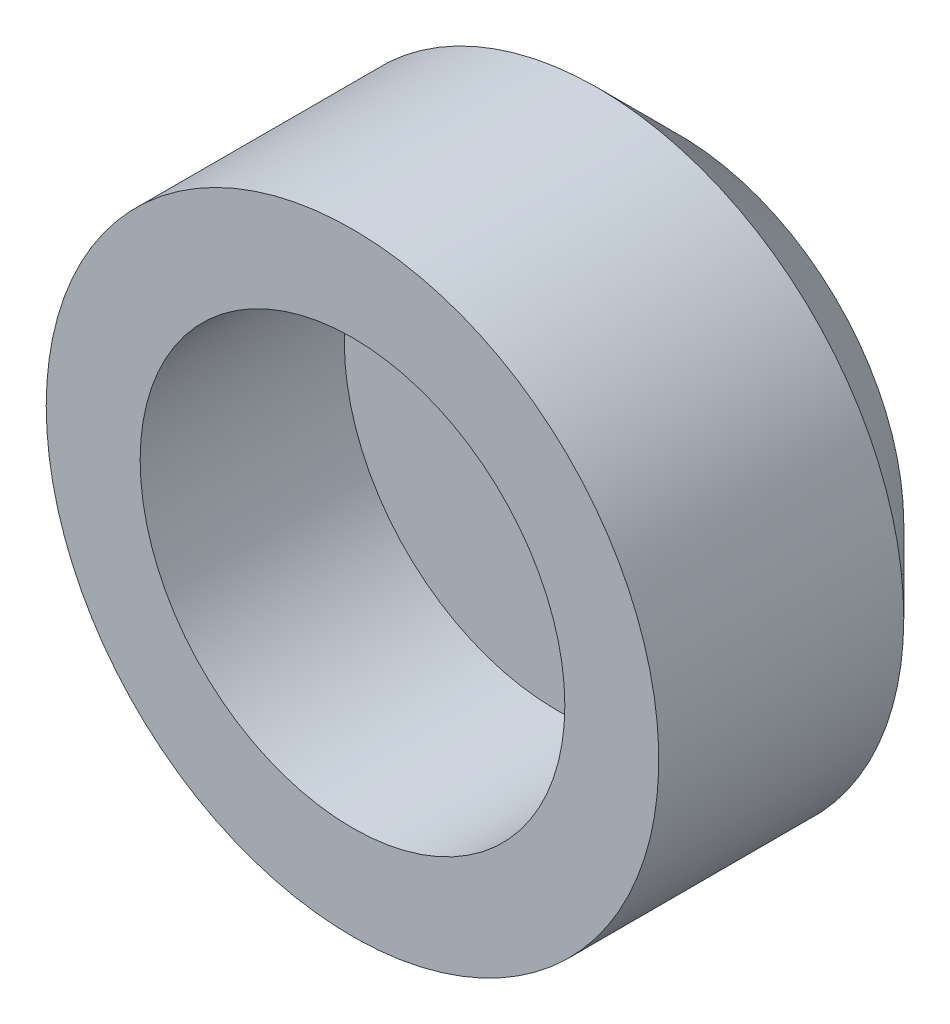
ISO-10303-21;
HEADER;
FILE_DESCRIPTION(('STEP AP214'),'2;1');
FILE_NAME('part.step','',(''),(''),'','','');
FILE_SCHEMA(('AUTOMOTIVE_DESIGN { 1 0 10303 214 1 1 1 1 }'));
ENDSEC;
DATA;
#1=APPLICATION_CONTEXT('core data for automotive mechanical design processes');
#2=APPLICATION_PROTOCOL_DEFINITION('international standard','automotive_design',2000,#1);
#3=PRODUCT_CONTEXT('',#1,'mechanical');
#4=PRODUCT('Part','Part','',(#3));
#5=PRODUCT_RELATED_PRODUCT_CATEGORY('part','',(#4));
#6=PRODUCT_DEFINITION_FORMATION('','',#4);
#7=PRODUCT_DEFINITION_CONTEXT('part definition',#1,'design');
#8=PRODUCT_DEFINITION('design','',#6,#7);
#9=PRODUCT_DEFINITION_SHAPE('','',#8);
#10=(LENGTH_UNIT() NAMED_UNIT(*) SI_UNIT(.MILLI.,.METRE.));
#11=(NAMED_UNIT(*) PLANE_ANGLE_UNIT() SI_UNIT($,.RADIAN.));
#12=(NAMED_UNIT(*) SI_UNIT($,.STERADIAN.) SOLID_ANGLE_UNIT());
#13=UNCERTAINTY_MEASURE_WITH_UNIT(LENGTH_MEASURE(1.E-05),#10,'distance_accuracy_value','');
#14=(GEOMETRIC_REPRESENTATION_CONTEXT(3) GLOBAL_UNCERTAINTY_ASSIGNED_CONTEXT((#13)) GLOBAL_UNIT_ASSIGNED_CONTEXT((#10,
#11,#12)) REPRESENTATION_CONTEXT('',''));
#15=CARTESIAN_POINT('',(0.,0.,0.));
#16=DIRECTION('',(0.,0.,1.));
#17=DIRECTION('',(1.,0.,0.));
#18=AXIS2_PLACEMENT_3D('',#15,#16,#17);
#19=CARTESIAN_POINT('',(0.,0.,1.5));
#20=DIRECTION('',(0.,0.,1.));
#21=DIRECTION('',(1.,0.,0.));
#22=AXIS2_PLACEMENT_3D('',#19,#20,#21);
#23=PLANE('',#22);
#24=CARTESIAN_POINT('',(0.,0.,1.5));
#25=DIRECTION('',(0.,0.,-1.));
#26=DIRECTION('',(-1.,0.,0.));
#27=AXIS2_PLACEMENT_3D('',#24,#25,#26);
#28=CIRCLE('',#27,2.6);
#29=CARTESIAN_POINT('',(-2.6,0.,1.5));
#30=VERTEX_POINT('',#29);
#31=EDGE_CURVE('E18',#30,#30,#28,.F.);
#32=ORIENTED_EDGE('',*,*,#31,.T.);
#33=EDGE_LOOP('',(#32));
#34=FACE_BOUND('',#33,.T.);
#35=ADVANCED_FACE('F15',(#34),#23,.T.);
#36=CARTESIAN_POINT('',(0.,0.,4.));
#37=DIRECTION('',(0.,0.,-1.));
#38=DIRECTION('',(-1.,0.,0.));
#39=AXIS2_PLACEMENT_3D('',#36,#37,#38);
#40=CYLINDRICAL_SURFACE('',#39,2.6);
#41=CARTESIAN_POINT('',(0.,0.,4.));
#42=DIRECTION('',(0.,0.,-1.));
#43=DIRECTION('',(-1.,0.,0.));
#44=AXIS2_PLACEMENT_3D('',#41,#42,#43);
#45=CIRCLE('',#44,2.6);
#46=CARTESIAN_POINT('',(-2.6,0.,4.));
#47=VERTEX_POINT('',#46);
#48=EDGE_CURVE('E31',#47,#47,#45,.T.);
#49=ORIENTED_EDGE('',*,*,#48,.F.);
#50=EDGE_LOOP('',(#49));
#51=FACE_BOUND('',#50,.T.);
#52=ORIENTED_EDGE('',*,*,#31,.F.);
#53=EDGE_LOOP('',(#52));
#54=FACE_BOUND('',#53,.T.);
#55=ADVANCED_FACE('F39',(#51,#54),#40,.F.);
#56=CARTESIAN_POINT('',(0.,0.,0.));
#57=DIRECTION('',(0.,0.,1.));
#58=DIRECTION('',(1.,0.,0.));
#59=AXIS2_PLACEMENT_3D('',#56,#57,#58);
#60=PLANE('',#59);
#61=CARTESIAN_POINT('',(0.,0.,-5.6843418860808E-11));
#62=DIRECTION('',(0.,0.,1.));
#63=DIRECTION('',(1.,0.,0.));
#64=AXIS2_PLACEMENT_3D('',#61,#62,#63);
#65=CIRCLE('',#64,2.75000000004866);
#66=CARTESIAN_POINT('',(2.75000000004866,0.,-5.6843418860808E-11));
#67=VERTEX_POINT('',#66);
#68=EDGE_CURVE('E27',#67,#67,#65,.T.);
#69=ORIENTED_EDGE('',*,*,#68,.F.);
#70=EDGE_LOOP('',(#69));
#71=FACE_BOUND('',#70,.T.);
#72=ADVANCED_FACE('F41',(#71),#60,.F.);
#73=CARTESIAN_POINT('',(0.,0.,4.));
#74=DIRECTION('',(0.,0.,1.));
#75=DIRECTION('',(1.,0.,0.));
#76=AXIS2_PLACEMENT_3D('',#73,#74,#75);
#77=PLANE('',#76);
#78=ORIENTED_EDGE('',*,*,#48,.T.);
#79=EDGE_LOOP('',(#78));
#80=FACE_BOUND('',#79,.T.);
#81=CARTESIAN_POINT('',(0.,0.,4.));
#82=DIRECTION('',(0.,0.,-1.));
#83=DIRECTION('',(-1.,0.,0.));
#84=AXIS2_PLACEMENT_3D('',#81,#82,#83);
#85=CIRCLE('',#84,3.75);
#86=CARTESIAN_POINT('',(-3.75,0.,4.));
#87=VERTEX_POINT('',#86);
#88=EDGE_CURVE('E22',#87,#87,#85,.T.);
#89=ORIENTED_EDGE('',*,*,#88,.F.);
#90=EDGE_LOOP('',(#89));
#91=FACE_BOUND('',#90,.T.);
#92=ADVANCED_FACE('F48',(#80,#91),#77,.T.);
#93=CARTESIAN_POINT('',(0.,0.,0.999999999862666));
#94=DIRECTION('',(0.,0.,1.));
#95=DIRECTION('',(1.,0.,0.));
#96=AXIS2_PLACEMENT_3D('',#93,#94,#95);
#97=CONICAL_SURFACE('',#96,3.74999999996817,0.785398163397448);
#98=CARTESIAN_POINT('',(0.,0.,0.999999999999998));
#99=DIRECTION('',(0.,0.,-1.));
#100=DIRECTION('',(-1.,0.,0.));
#101=AXIS2_PLACEMENT_3D('',#98,#99,#100);
#102=CIRCLE('',#101,3.75);
#103=CARTESIAN_POINT('',(-3.75,0.,0.999999999999998));
#104=VERTEX_POINT('',#103);
#105=EDGE_CURVE('E10',#104,#104,#102,.F.);
#106=ORIENTED_EDGE('',*,*,#105,.F.);
#107=EDGE_LOOP('',(#106));
#108=FACE_BOUND('',#107,.T.);
#109=ORIENTED_EDGE('',*,*,#68,.T.);
#110=EDGE_LOOP('',(#109));
#111=FACE_BOUND('',#110,.T.);
#112=ADVANCED_FACE('F54',(#108,#111),#97,.T.);
#113=CARTESIAN_POINT('',(0.,0.,4.));
#114=DIRECTION('',(0.,0.,-1.));
#115=DIRECTION('',(-1.,0.,0.));
#116=AXIS2_PLACEMENT_3D('',#113,#114,#115);
#117=CYLINDRICAL_SURFACE('',#116,3.75);
#118=ORIENTED_EDGE('',*,*,#105,.T.);
#119=EDGE_LOOP('',(#118));
#120=FACE_BOUND('',#119,.T.);
#121=ORIENTED_EDGE('',*,*,#88,.T.);
#122=EDGE_LOOP('',(#121));
#123=FACE_BOUND('',#122,.T.);
#124=ADVANCED_FACE('F52',(#120,#123),#117,.T.);
#125=CLOSED_SHELL('',(#35,#55,#72,#92,#112,#124));
#126=MANIFOLD_SOLID_BREP('B1',#125);
#127=ADVANCED_BREP_SHAPE_REPRESENTATION('',(#18,#126),#14);
#128=SHAPE_DEFINITION_REPRESENTATION(#9,#127);
ENDSEC;
END-ISO-10303-21;
